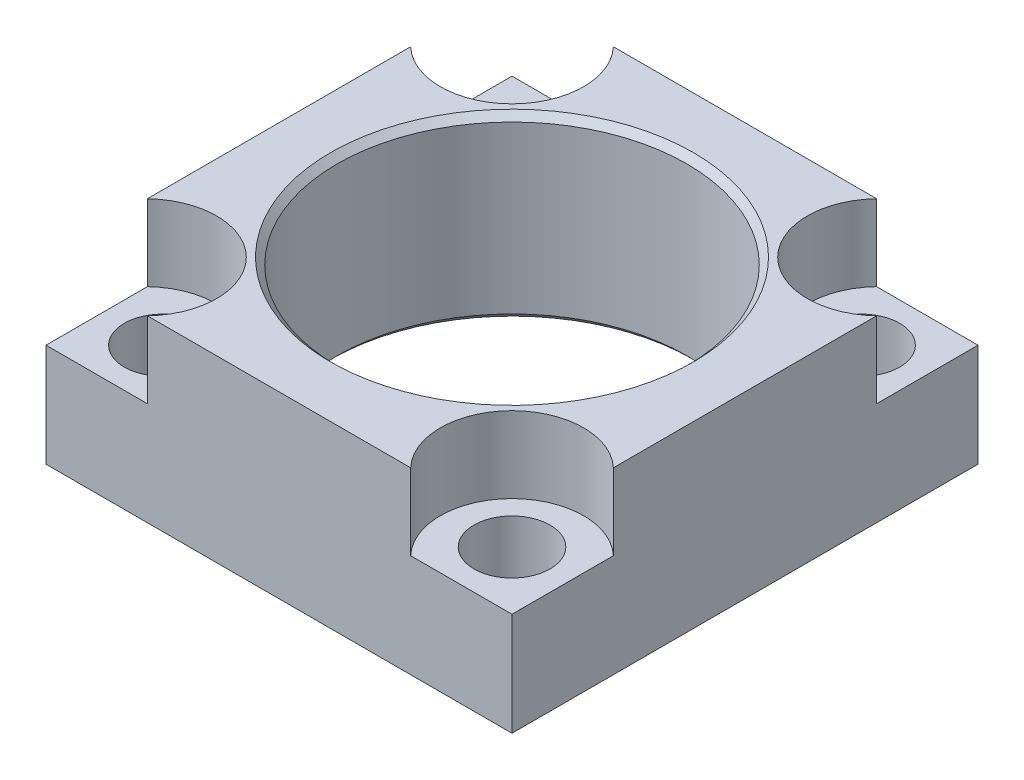
ISO-10303-21;
HEADER;
FILE_DESCRIPTION(('STEP AP214'),'2;1');
FILE_NAME('part.step','',(''),(''),'','','');
FILE_SCHEMA(('AUTOMOTIVE_DESIGN { 1 0 10303 214 1 1 1 1 }'));
ENDSEC;
DATA;
#1=APPLICATION_CONTEXT('core data for automotive mechanical design processes');
#2=APPLICATION_PROTOCOL_DEFINITION('international standard','automotive_design',2000,#1);
#3=PRODUCT_CONTEXT('',#1,'mechanical');
#4=PRODUCT('Part','Part','',(#3));
#5=PRODUCT_RELATED_PRODUCT_CATEGORY('part','',(#4));
#6=PRODUCT_DEFINITION_FORMATION('','',#4);
#7=PRODUCT_DEFINITION_CONTEXT('part definition',#1,'design');
#8=PRODUCT_DEFINITION('design','',#6,#7);
#9=PRODUCT_DEFINITION_SHAPE('','',#8);
#10=(LENGTH_UNIT() NAMED_UNIT(*) SI_UNIT(.MILLI.,.METRE.));
#11=(NAMED_UNIT(*) PLANE_ANGLE_UNIT() SI_UNIT($,.RADIAN.));
#12=(NAMED_UNIT(*) SI_UNIT($,.STERADIAN.) SOLID_ANGLE_UNIT());
#13=UNCERTAINTY_MEASURE_WITH_UNIT(LENGTH_MEASURE(1.E-05),#10,'distance_accuracy_value','');
#14=(GEOMETRIC_REPRESENTATION_CONTEXT(3) GLOBAL_UNCERTAINTY_ASSIGNED_CONTEXT((#13)) GLOBAL_UNIT_ASSIGNED_CONTEXT((#10,
#11,#12)) REPRESENTATION_CONTEXT('',''));
#15=CARTESIAN_POINT('',(0.,0.,0.));
#16=DIRECTION('',(0.,0.,1.));
#17=DIRECTION('',(1.,0.,0.));
#18=AXIS2_PLACEMENT_3D('',#15,#16,#17);
#19=CARTESIAN_POINT('',(0.,31.75,0.));
#20=DIRECTION('',(0.,-1.,0.));
#21=DIRECTION('',(0.,0.,-1.));
#22=AXIS2_PLACEMENT_3D('',#19,#20,#21);
#23=CYLINDRICAL_SURFACE('',#22,30.9753);
#24=CARTESIAN_POINT('',(0.,30.5943,0.));
#25=DIRECTION('',(0.,-1.,0.));
#26=DIRECTION('',(0.,0.,-1.));
#27=AXIS2_PLACEMENT_3D('',#24,#25,#26);
#28=CIRCLE('',#27,30.9753);
#29=CARTESIAN_POINT('',(0.,30.5943,-30.9753));
#30=VERTEX_POINT('',#29);
#31=EDGE_CURVE('E257',#30,#30,#28,.T.);
#32=ORIENTED_EDGE('',*,*,#31,.F.);
#33=EDGE_LOOP('',(#32));
#34=FACE_BOUND('',#33,.T.);
#35=CARTESIAN_POINT('',(0.,1.15570000000001,0.));
#36=DIRECTION('',(0.,-1.,0.));
#37=DIRECTION('',(0.,0.,-1.));
#38=AXIS2_PLACEMENT_3D('',#35,#36,#37);
#39=CIRCLE('',#38,30.9753);
#40=CARTESIAN_POINT('',(0.,1.15570000000001,-30.9753));
#41=VERTEX_POINT('',#40);
#42=EDGE_CURVE('E263',#41,#41,#39,.T.);
#43=ORIENTED_EDGE('',*,*,#42,.T.);
#44=EDGE_LOOP('',(#43));
#45=FACE_BOUND('',#44,.T.);
#46=ADVANCED_FACE('F33',(#34,#45),#23,.F.);
#47=CARTESIAN_POINT('',(-41.275,0.,41.275));
#48=DIRECTION('',(0.,1.,0.));
#49=DIRECTION('',(0.,0.,1.));
#50=AXIS2_PLACEMENT_3D('',#47,#48,#49);
#51=PLANE('',#50);
#52=DIRECTION('',(0.,0.,1.));
#53=VECTOR('',#52,1.);
#54=CARTESIAN_POINT('',(-41.275,0.,-41.275));
#55=LINE('',#54,#53);
#56=CARTESIAN_POINT('',(-41.275,0.,-41.275));
#57=VERTEX_POINT('',#56);
#58=CARTESIAN_POINT('',(-41.275,0.,41.275));
#59=VERTEX_POINT('',#58);
#60=EDGE_CURVE('E171',#57,#59,#55,.T.);
#61=ORIENTED_EDGE('',*,*,#60,.F.);
#62=DIRECTION('',(-1.,0.,0.));
#63=VECTOR('',#62,1.);
#64=CARTESIAN_POINT('',(-41.275,0.,-41.275));
#65=LINE('',#64,#63);
#66=CARTESIAN_POINT('',(41.275,0.,-41.275));
#67=VERTEX_POINT('',#66);
#68=EDGE_CURVE('E140',#67,#57,#65,.T.);
#69=ORIENTED_EDGE('',*,*,#68,.F.);
#70=DIRECTION('',(0.,0.,-1.));
#71=VECTOR('',#70,1.);
#72=CARTESIAN_POINT('',(41.275,0.,-41.275));
#73=LINE('',#72,#71);
#74=CARTESIAN_POINT('',(41.275,0.,41.275));
#75=VERTEX_POINT('',#74);
#76=EDGE_CURVE('E159',#75,#67,#73,.T.);
#77=ORIENTED_EDGE('',*,*,#76,.F.);
#78=DIRECTION('',(1.,0.,0.));
#79=VECTOR('',#78,1.);
#80=CARTESIAN_POINT('',(-41.275,0.,41.275));
#81=LINE('',#80,#79);
#82=EDGE_CURVE('E166',#59,#75,#81,.T.);
#83=ORIENTED_EDGE('',*,*,#82,.F.);
#84=EDGE_LOOP('',(#61,#69,#77,#83));
#85=FACE_BOUND('',#84,.T.);
#86=CARTESIAN_POINT('',(30.9626,0.,-30.9626));
#87=DIRECTION('',(0.,1.,0.));
#88=DIRECTION('',(0.,0.,1.));
#89=AXIS2_PLACEMENT_3D('',#86,#87,#88);
#90=CIRCLE('',#89,6.74370000000001);
#91=CARTESIAN_POINT('',(30.9626,0.,-24.2189));
#92=VERTEX_POINT('',#91);
#93=EDGE_CURVE('E228',#92,#92,#90,.T.);
#94=ORIENTED_EDGE('',*,*,#93,.T.);
#95=EDGE_LOOP('',(#94));
#96=FACE_BOUND('',#95,.T.);
#97=CARTESIAN_POINT('',(30.9626,0.,30.9626));
#98=DIRECTION('',(0.,1.,0.));
#99=DIRECTION('',(0.,0.,1.));
#100=AXIS2_PLACEMENT_3D('',#97,#98,#99);
#101=CIRCLE('',#100,6.74370000000001);
#102=CARTESIAN_POINT('',(30.9626,0.,37.7063));
#103=VERTEX_POINT('',#102);
#104=EDGE_CURVE('E236',#103,#103,#101,.T.);
#105=ORIENTED_EDGE('',*,*,#104,.T.);
#106=EDGE_LOOP('',(#105));
#107=FACE_BOUND('',#106,.T.);
#108=CARTESIAN_POINT('',(-30.9626,0.,-30.9626));
#109=DIRECTION('',(0.,1.,0.));
#110=DIRECTION('',(0.,0.,1.));
#111=AXIS2_PLACEMENT_3D('',#108,#109,#110);
#112=CIRCLE('',#111,6.74370000000001);
#113=CARTESIAN_POINT('',(-30.9626,0.,-24.2189));
#114=VERTEX_POINT('',#113);
#115=EDGE_CURVE('E242',#114,#114,#112,.T.);
#116=ORIENTED_EDGE('',*,*,#115,.T.);
#117=EDGE_LOOP('',(#116));
#118=FACE_BOUND('',#117,.T.);
#119=CARTESIAN_POINT('',(-30.9626,0.,30.9626));
#120=DIRECTION('',(0.,1.,0.));
#121=DIRECTION('',(0.,0.,1.));
#122=AXIS2_PLACEMENT_3D('',#119,#120,#121);
#123=CIRCLE('',#122,6.74370000000001);
#124=CARTESIAN_POINT('',(-30.9626,0.,37.7063));
#125=VERTEX_POINT('',#124);
#126=EDGE_CURVE('E248',#125,#125,#123,.T.);
#127=ORIENTED_EDGE('',*,*,#126,.T.);
#128=EDGE_LOOP('',(#127));
#129=FACE_BOUND('',#128,.T.);
#130=CARTESIAN_POINT('',(0.,0.,0.));
#131=DIRECTION('',(0.,-1.,0.));
#132=DIRECTION('',(0.,0.,-1.));
#133=AXIS2_PLACEMENT_3D('',#130,#131,#132);
#134=CIRCLE('',#133,32.131);
#135=CARTESIAN_POINT('',(0.,0.,-32.131));
#136=VERTEX_POINT('',#135);
#137=EDGE_CURVE('E260',#136,#136,#134,.T.);
#138=ORIENTED_EDGE('',*,*,#137,.F.);
#139=EDGE_LOOP('',(#138));
#140=FACE_BOUND('',#139,.T.);
#141=ADVANCED_FACE('F173',(#85,#96,#107,#118,#129,#140),#51,.F.);
#142=CARTESIAN_POINT('',(-41.275,31.75,41.275));
#143=DIRECTION('',(0.,1.,0.));
#144=DIRECTION('',(0.,0.,1.));
#145=AXIS2_PLACEMENT_3D('',#142,#143,#144);
#146=PLANE('',#145);
#147=CARTESIAN_POINT('',(-32.512,31.75,-32.512));
#148=DIRECTION('',(0.,1.,0.));
#149=DIRECTION('',(0.,0.,1.));
#150=AXIS2_PLACEMENT_3D('',#147,#148,#149);
#151=CIRCLE('',#150,12.7);
#152=CARTESIAN_POINT('',(-41.275,31.75,-23.3196210369676));
#153=VERTEX_POINT('',#152);
#154=CARTESIAN_POINT('',(-23.3196210369676,31.75,-41.275));
#155=VERTEX_POINT('',#154);
#156=EDGE_CURVE('E227',#153,#155,#151,.T.);
#157=ORIENTED_EDGE('',*,*,#156,.F.);
#158=DIRECTION('',(0.,0.,1.));
#159=VECTOR('',#158,1.);
#160=CARTESIAN_POINT('',(-41.275,31.75,-41.275));
#161=LINE('',#160,#159);
#162=CARTESIAN_POINT('',(-41.275,31.75,23.3196210369676));
#163=VERTEX_POINT('',#162);
#164=EDGE_CURVE('E175',#153,#163,#161,.T.);
#165=ORIENTED_EDGE('',*,*,#164,.T.);
#166=CARTESIAN_POINT('',(-32.512,31.75,32.512));
#167=DIRECTION('',(0.,1.,0.));
#168=DIRECTION('',(0.,0.,-1.));
#169=AXIS2_PLACEMENT_3D('',#166,#167,#168);
#170=CIRCLE('',#169,12.7);
#171=CARTESIAN_POINT('',(-23.3196210369676,31.75,41.275));
#172=VERTEX_POINT('',#171);
#173=EDGE_CURVE('E190',#172,#163,#170,.T.);
#174=ORIENTED_EDGE('',*,*,#173,.F.);
#175=DIRECTION('',(1.,0.,0.));
#176=VECTOR('',#175,1.);
#177=CARTESIAN_POINT('',(-41.275,31.75,41.275));
#178=LINE('',#177,#176);
#179=CARTESIAN_POINT('',(23.3196210369676,31.75,41.275));
#180=VERTEX_POINT('',#179);
#181=EDGE_CURVE('E181',#172,#180,#178,.T.);
#182=ORIENTED_EDGE('',*,*,#181,.T.);
#183=CARTESIAN_POINT('',(32.512,31.75,32.512));
#184=DIRECTION('',(0.,1.,0.));
#185=DIRECTION('',(0.,0.,1.));
#186=AXIS2_PLACEMENT_3D('',#183,#184,#185);
#187=CIRCLE('',#186,12.7);
#188=CARTESIAN_POINT('',(41.275,31.75,23.3196210369676));
#189=VERTEX_POINT('',#188);
#190=EDGE_CURVE('E206',#189,#180,#187,.T.);
#191=ORIENTED_EDGE('',*,*,#190,.F.);
#192=DIRECTION('',(0.,0.,-1.));
#193=VECTOR('',#192,1.);
#194=CARTESIAN_POINT('',(41.275,31.75,-41.275));
#195=LINE('',#194,#193);
#196=CARTESIAN_POINT('',(41.275,31.75,-23.3196210369676));
#197=VERTEX_POINT('',#196);
#198=EDGE_CURVE('E147',#189,#197,#195,.T.);
#199=ORIENTED_EDGE('',*,*,#198,.T.);
#200=CARTESIAN_POINT('',(32.512,31.75,-32.512));
#201=DIRECTION('',(0.,1.,0.));
#202=DIRECTION('',(0.,0.,-1.));
#203=AXIS2_PLACEMENT_3D('',#200,#201,#202);
#204=CIRCLE('',#203,12.7);
#205=CARTESIAN_POINT('',(23.3196210369676,31.75,-41.275));
#206=VERTEX_POINT('',#205);
#207=EDGE_CURVE('E218',#206,#197,#204,.T.);
#208=ORIENTED_EDGE('',*,*,#207,.F.);
#209=DIRECTION('',(-1.,0.,0.));
#210=VECTOR('',#209,1.);
#211=CARTESIAN_POINT('',(-41.275,31.75,-41.275));
#212=LINE('',#211,#210);
#213=EDGE_CURVE('E143',#206,#155,#212,.T.);
#214=ORIENTED_EDGE('',*,*,#213,.T.);
#215=EDGE_LOOP('',(#157,#165,#174,#182,#191,#199,#208,#214));
#216=FACE_BOUND('',#215,.T.);
#217=CARTESIAN_POINT('',(0.,31.75,0.));
#218=DIRECTION('',(0.,-1.,0.));
#219=DIRECTION('',(0.,0.,-1.));
#220=AXIS2_PLACEMENT_3D('',#217,#218,#219);
#221=CIRCLE('',#220,32.131);
#222=CARTESIAN_POINT('',(0.,31.75,-32.131));
#223=VERTEX_POINT('',#222);
#224=EDGE_CURVE('E254',#223,#223,#221,.T.);
#225=ORIENTED_EDGE('',*,*,#224,.T.);
#226=EDGE_LOOP('',(#225));
#227=FACE_BOUND('',#226,.T.);
#228=ADVANCED_FACE('F285',(#216,#227),#146,.T.);
#229=CARTESIAN_POINT('',(-32.512,18.2626,32.512));
#230=DIRECTION('',(0.,-1.,0.));
#231=DIRECTION('',(0.,0.,-1.));
#232=AXIS2_PLACEMENT_3D('',#229,#230,#231);
#233=PLANE('',#232);
#234=DIRECTION('',(1.,0.,0.));
#235=VECTOR('',#234,1.);
#236=CARTESIAN_POINT('',(-23.3196210369676,18.2626,41.275));
#237=LINE('',#236,#235);
#238=CARTESIAN_POINT('',(-41.275,18.2626,41.275));
#239=VERTEX_POINT('',#238);
#240=CARTESIAN_POINT('',(-23.3196210369676,18.2626,41.275));
#241=VERTEX_POINT('',#240);
#242=EDGE_CURVE('E193',#239,#241,#237,.T.);
#243=ORIENTED_EDGE('',*,*,#242,.T.);
#244=CARTESIAN_POINT('',(-32.512,18.2626,32.512));
#245=DIRECTION('',(0.,1.,0.));
#246=DIRECTION('',(0.,0.,-1.));
#247=AXIS2_PLACEMENT_3D('',#244,#245,#246);
#248=CIRCLE('',#247,12.7);
#249=CARTESIAN_POINT('',(-41.275,18.2626,23.3196210369676));
#250=VERTEX_POINT('',#249);
#251=EDGE_CURVE('E196',#241,#250,#248,.T.);
#252=ORIENTED_EDGE('',*,*,#251,.T.);
#253=DIRECTION('',(0.,0.,1.));
#254=VECTOR('',#253,1.);
#255=CARTESIAN_POINT('',(-41.275,18.2626,41.275));
#256=LINE('',#255,#254);
#257=EDGE_CURVE('E187',#250,#239,#256,.T.);
#258=ORIENTED_EDGE('',*,*,#257,.T.);
#259=EDGE_LOOP('',(#243,#252,#258));
#260=FACE_BOUND('',#259,.T.);
#261=CARTESIAN_POINT('',(-30.9626,18.2626,30.9626));
#262=DIRECTION('',(0.,1.,0.));
#263=DIRECTION('',(0.,0.,1.));
#264=AXIS2_PLACEMENT_3D('',#261,#262,#263);
#265=CIRCLE('',#264,6.74370000000001);
#266=CARTESIAN_POINT('',(-30.9626,18.2626,37.7063));
#267=VERTEX_POINT('',#266);
#268=EDGE_CURVE('E251',#267,#267,#265,.T.);
#269=ORIENTED_EDGE('',*,*,#268,.F.);
#270=EDGE_LOOP('',(#269));
#271=FACE_BOUND('',#270,.T.);
#272=ADVANCED_FACE('F293',(#260,#271),#233,.F.);
#273=CARTESIAN_POINT('',(32.512,18.2626,-32.512));
#274=DIRECTION('',(0.,-1.,0.));
#275=DIRECTION('',(0.,0.,-1.));
#276=AXIS2_PLACEMENT_3D('',#273,#274,#275);
#277=PLANE('',#276);
#278=DIRECTION('',(-1.,0.,0.));
#279=VECTOR('',#278,1.);
#280=CARTESIAN_POINT('',(23.3196210369676,18.2626,-41.275));
#281=LINE('',#280,#279);
#282=CARTESIAN_POINT('',(41.275,18.2626,-41.275));
#283=VERTEX_POINT('',#282);
#284=CARTESIAN_POINT('',(23.3196210369676,18.2626,-41.275));
#285=VERTEX_POINT('',#284);
#286=EDGE_CURVE('E220',#283,#285,#281,.T.);
#287=ORIENTED_EDGE('',*,*,#286,.T.);
#288=CARTESIAN_POINT('',(32.512,18.2626,-32.512));
#289=DIRECTION('',(0.,1.,0.));
#290=DIRECTION('',(0.,0.,-1.));
#291=AXIS2_PLACEMENT_3D('',#288,#289,#290);
#292=CIRCLE('',#291,12.7);
#293=CARTESIAN_POINT('',(41.275,18.2626,-23.3196210369676));
#294=VERTEX_POINT('',#293);
#295=EDGE_CURVE('E222',#285,#294,#292,.T.);
#296=ORIENTED_EDGE('',*,*,#295,.T.);
#297=DIRECTION('',(0.,0.,-1.));
#298=VECTOR('',#297,1.);
#299=CARTESIAN_POINT('',(41.275,18.2626,-41.275));
#300=LINE('',#299,#298);
#301=EDGE_CURVE('E56',#294,#283,#300,.T.);
#302=ORIENTED_EDGE('',*,*,#301,.T.);
#303=EDGE_LOOP('',(#287,#296,#302));
#304=FACE_BOUND('',#303,.T.);
#305=CARTESIAN_POINT('',(30.9626,18.2626,-30.9626));
#306=DIRECTION('',(0.,1.,0.));
#307=DIRECTION('',(0.,0.,1.));
#308=AXIS2_PLACEMENT_3D('',#305,#306,#307);
#309=CIRCLE('',#308,6.74370000000001);
#310=CARTESIAN_POINT('',(30.9626,18.2626,-24.2189));
#311=VERTEX_POINT('',#310);
#312=EDGE_CURVE('E233',#311,#311,#309,.T.);
#313=ORIENTED_EDGE('',*,*,#312,.F.);
#314=EDGE_LOOP('',(#313));
#315=FACE_BOUND('',#314,.T.);
#316=ADVANCED_FACE('F303',(#304,#315),#277,.F.);
#317=CARTESIAN_POINT('',(-41.275,31.75,-41.275));
#318=DIRECTION('',(1.,0.,0.));
#319=DIRECTION('',(0.,0.,-1.));
#320=AXIS2_PLACEMENT_3D('',#317,#318,#319);
#321=PLANE('',#320);
#322=ORIENTED_EDGE('',*,*,#164,.F.);
#323=DIRECTION('',(0.,1.,0.));
#324=VECTOR('',#323,1.);
#325=CARTESIAN_POINT('',(-41.275,18.2626,-23.3196210369676));
#326=LINE('',#325,#324);
#327=CARTESIAN_POINT('',(-41.275,18.2626,-23.3196210369676));
#328=VERTEX_POINT('',#327);
#329=EDGE_CURVE('E135',#328,#153,#326,.T.);
#330=ORIENTED_EDGE('',*,*,#329,.F.);
#331=DIRECTION('',(0.,0.,1.));
#332=VECTOR('',#331,1.);
#333=CARTESIAN_POINT('',(-41.275,18.2626,-41.275));
#334=LINE('',#333,#332);
#335=CARTESIAN_POINT('',(-41.275,18.2626,-41.275));
#336=VERTEX_POINT('',#335);
#337=EDGE_CURVE('E124',#336,#328,#334,.T.);
#338=ORIENTED_EDGE('',*,*,#337,.F.);
#339=DIRECTION('',(0.,-1.,0.));
#340=VECTOR('',#339,1.);
#341=CARTESIAN_POINT('',(-41.275,31.75,-41.275));
#342=LINE('',#341,#340);
#343=EDGE_CURVE('E133',#336,#57,#342,.T.);
#344=ORIENTED_EDGE('',*,*,#343,.T.);
#345=ORIENTED_EDGE('',*,*,#60,.T.);
#346=DIRECTION('',(0.,-1.,0.));
#347=VECTOR('',#346,1.);
#348=CARTESIAN_POINT('',(-41.275,31.75,41.275));
#349=LINE('',#348,#347);
#350=EDGE_CURVE('E11',#239,#59,#349,.T.);
#351=ORIENTED_EDGE('',*,*,#350,.F.);
#352=ORIENTED_EDGE('',*,*,#257,.F.);
#353=DIRECTION('',(0.,1.,0.));
#354=VECTOR('',#353,1.);
#355=CARTESIAN_POINT('',(-41.275,18.2626,23.3196210369676));
#356=LINE('',#355,#354);
#357=EDGE_CURVE('E177',#250,#163,#356,.T.);
#358=ORIENTED_EDGE('',*,*,#357,.T.);
#359=EDGE_LOOP('',(#322,#330,#338,#344,#345,#351,#352,#358));
#360=FACE_BOUND('',#359,.T.);
#361=ADVANCED_FACE('F35',(#360),#321,.F.);
#362=CARTESIAN_POINT('',(-41.275,31.75,41.275));
#363=DIRECTION('',(0.,0.,-1.));
#364=DIRECTION('',(-1.,0.,0.));
#365=AXIS2_PLACEMENT_3D('',#362,#363,#364);
#366=PLANE('',#365);
#367=DIRECTION('',(1.,0.,0.));
#368=VECTOR('',#367,1.);
#369=CARTESIAN_POINT('',(23.3196210369676,18.2626,41.275));
#370=LINE('',#369,#368);
#371=CARTESIAN_POINT('',(23.3196210369676,18.2626,41.275));
#372=VERTEX_POINT('',#371);
#373=CARTESIAN_POINT('',(41.275,18.2626,41.275));
#374=VERTEX_POINT('',#373);
#375=EDGE_CURVE('E203',#372,#374,#370,.T.);
#376=ORIENTED_EDGE('',*,*,#375,.F.);
#377=DIRECTION('',(0.,1.,0.));
#378=VECTOR('',#377,1.);
#379=CARTESIAN_POINT('',(23.3196210369676,18.2626,41.275));
#380=LINE('',#379,#378);
#381=EDGE_CURVE('E194',#372,#180,#380,.T.);
#382=ORIENTED_EDGE('',*,*,#381,.T.);
#383=ORIENTED_EDGE('',*,*,#181,.F.);
#384=DIRECTION('',(0.,1.,0.));
#385=VECTOR('',#384,1.);
#386=CARTESIAN_POINT('',(-23.3196210369676,18.2626,41.275));
#387=LINE('',#386,#385);
#388=EDGE_CURVE('E185',#241,#172,#387,.T.);
#389=ORIENTED_EDGE('',*,*,#388,.F.);
#390=ORIENTED_EDGE('',*,*,#242,.F.);
#391=ORIENTED_EDGE('',*,*,#350,.T.);
#392=ORIENTED_EDGE('',*,*,#82,.T.);
#393=DIRECTION('',(0.,-1.,0.));
#394=VECTOR('',#393,1.);
#395=CARTESIAN_POINT('',(41.275,31.75,41.275));
#396=LINE('',#395,#394);
#397=EDGE_CURVE('E41',#374,#75,#396,.T.);
#398=ORIENTED_EDGE('',*,*,#397,.F.);
#399=EDGE_LOOP('',(#376,#382,#383,#389,#390,#391,#392,#398));
#400=FACE_BOUND('',#399,.T.);
#401=ADVANCED_FACE('F167',(#400),#366,.F.);
#402=CARTESIAN_POINT('',(41.275,31.75,-41.275));
#403=DIRECTION('',(-1.,0.,0.));
#404=DIRECTION('',(0.,0.,1.));
#405=AXIS2_PLACEMENT_3D('',#402,#403,#404);
#406=PLANE('',#405);
#407=ORIENTED_EDGE('',*,*,#301,.F.);
#408=DIRECTION('',(0.,1.,0.));
#409=VECTOR('',#408,1.);
#410=CARTESIAN_POINT('',(41.275,18.2626,-23.3196210369676));
#411=LINE('',#410,#409);
#412=EDGE_CURVE('E208',#294,#197,#411,.T.);
#413=ORIENTED_EDGE('',*,*,#412,.T.);
#414=ORIENTED_EDGE('',*,*,#198,.F.);
#415=DIRECTION('',(0.,1.,0.));
#416=VECTOR('',#415,1.);
#417=CARTESIAN_POINT('',(41.275,18.2626,23.3196210369676));
#418=LINE('',#417,#416);
#419=CARTESIAN_POINT('',(41.275,18.2626,23.3196210369676));
#420=VERTEX_POINT('',#419);
#421=EDGE_CURVE('E201',#420,#189,#418,.T.);
#422=ORIENTED_EDGE('',*,*,#421,.F.);
#423=DIRECTION('',(0.,0.,-1.));
#424=VECTOR('',#423,1.);
#425=CARTESIAN_POINT('',(41.275,18.2626,41.275));
#426=LINE('',#425,#424);
#427=EDGE_CURVE('E162',#374,#420,#426,.T.);
#428=ORIENTED_EDGE('',*,*,#427,.F.);
#429=ORIENTED_EDGE('',*,*,#397,.T.);
#430=ORIENTED_EDGE('',*,*,#76,.T.);
#431=DIRECTION('',(0.,-1.,0.));
#432=VECTOR('',#431,1.);
#433=CARTESIAN_POINT('',(41.275,31.75,-41.275));
#434=LINE('',#433,#432);
#435=EDGE_CURVE('E142',#283,#67,#434,.T.);
#436=ORIENTED_EDGE('',*,*,#435,.F.);
#437=EDGE_LOOP('',(#407,#413,#414,#422,#428,#429,#430,#436));
#438=FACE_BOUND('',#437,.T.);
#439=ADVANCED_FACE('F156',(#438),#406,.F.);
#440=CARTESIAN_POINT('',(-41.275,31.75,-41.275));
#441=DIRECTION('',(0.,0.,1.));
#442=DIRECTION('',(1.,0.,0.));
#443=AXIS2_PLACEMENT_3D('',#440,#441,#442);
#444=PLANE('',#443);
#445=DIRECTION('',(-1.,0.,0.));
#446=VECTOR('',#445,1.);
#447=CARTESIAN_POINT('',(-23.3196210369676,18.2626,-41.275));
#448=LINE('',#447,#446);
#449=CARTESIAN_POINT('',(-23.3196210369676,18.2626,-41.275));
#450=VERTEX_POINT('',#449);
#451=EDGE_CURVE('E121',#450,#336,#448,.T.);
#452=ORIENTED_EDGE('',*,*,#451,.F.);
#453=DIRECTION('',(0.,1.,0.));
#454=VECTOR('',#453,1.);
#455=CARTESIAN_POINT('',(-23.3196210369676,18.2626,-41.275));
#456=LINE('',#455,#454);
#457=EDGE_CURVE('E136',#450,#155,#456,.T.);
#458=ORIENTED_EDGE('',*,*,#457,.T.);
#459=ORIENTED_EDGE('',*,*,#213,.F.);
#460=DIRECTION('',(0.,1.,0.));
#461=VECTOR('',#460,1.);
#462=CARTESIAN_POINT('',(23.3196210369676,18.2626,-41.275));
#463=LINE('',#462,#461);
#464=EDGE_CURVE('E214',#285,#206,#463,.T.);
#465=ORIENTED_EDGE('',*,*,#464,.F.);
#466=ORIENTED_EDGE('',*,*,#286,.F.);
#467=ORIENTED_EDGE('',*,*,#435,.T.);
#468=ORIENTED_EDGE('',*,*,#68,.T.);
#469=ORIENTED_EDGE('',*,*,#343,.F.);
#470=EDGE_LOOP('',(#452,#458,#459,#465,#466,#467,#468,#469));
#471=FACE_BOUND('',#470,.T.);
#472=ADVANCED_FACE('F138',(#471),#444,.F.);
#473=CARTESIAN_POINT('',(-32.512,18.2626,32.512));
#474=DIRECTION('',(0.,1.,0.));
#475=DIRECTION('',(0.,0.,1.));
#476=AXIS2_PLACEMENT_3D('',#473,#474,#475);
#477=CYLINDRICAL_SURFACE('',#476,12.7);
#478=ORIENTED_EDGE('',*,*,#173,.T.);
#479=ORIENTED_EDGE('',*,*,#357,.F.);
#480=ORIENTED_EDGE('',*,*,#251,.F.);
#481=ORIENTED_EDGE('',*,*,#388,.T.);
#482=EDGE_LOOP('',(#478,#479,#480,#481));
#483=FACE_BOUND('',#482,.T.);
#484=ADVANCED_FACE('F290',(#483),#477,.F.);
#485=CARTESIAN_POINT('',(32.512,18.2626,32.512));
#486=DIRECTION('',(0.,1.,0.));
#487=DIRECTION('',(0.,0.,1.));
#488=AXIS2_PLACEMENT_3D('',#485,#486,#487);
#489=CYLINDRICAL_SURFACE('',#488,12.7);
#490=ORIENTED_EDGE('',*,*,#190,.T.);
#491=ORIENTED_EDGE('',*,*,#381,.F.);
#492=CARTESIAN_POINT('',(32.512,18.2626,32.512));
#493=DIRECTION('',(0.,1.,0.));
#494=DIRECTION('',(0.,0.,1.));
#495=AXIS2_PLACEMENT_3D('',#492,#493,#494);
#496=CIRCLE('',#495,12.7);
#497=EDGE_CURVE('E210',#420,#372,#496,.T.);
#498=ORIENTED_EDGE('',*,*,#497,.F.);
#499=ORIENTED_EDGE('',*,*,#421,.T.);
#500=EDGE_LOOP('',(#490,#491,#498,#499));
#501=FACE_BOUND('',#500,.T.);
#502=ADVANCED_FACE('F324',(#501),#489,.F.);
#503=CARTESIAN_POINT('',(32.512,18.2626,32.512));
#504=DIRECTION('',(0.,1.,0.));
#505=DIRECTION('',(0.,0.,1.));
#506=AXIS2_PLACEMENT_3D('',#503,#504,#505);
#507=PLANE('',#506);
#508=CARTESIAN_POINT('',(30.9626,18.2626,30.9626));
#509=DIRECTION('',(0.,1.,0.));
#510=DIRECTION('',(0.,0.,1.));
#511=AXIS2_PLACEMENT_3D('',#508,#509,#510);
#512=CIRCLE('',#511,6.74370000000001);
#513=CARTESIAN_POINT('',(30.9626,18.2626,37.7063));
#514=VERTEX_POINT('',#513);
#515=EDGE_CURVE('E239',#514,#514,#512,.T.);
#516=ORIENTED_EDGE('',*,*,#515,.F.);
#517=EDGE_LOOP('',(#516));
#518=FACE_BOUND('',#517,.T.);
#519=ORIENTED_EDGE('',*,*,#427,.T.);
#520=ORIENTED_EDGE('',*,*,#497,.T.);
#521=ORIENTED_EDGE('',*,*,#375,.T.);
#522=EDGE_LOOP('',(#519,#520,#521));
#523=FACE_BOUND('',#522,.T.);
#524=ADVANCED_FACE('F320',(#518,#523),#507,.T.);
#525=CARTESIAN_POINT('',(32.512,18.2626,-32.512));
#526=DIRECTION('',(0.,1.,0.));
#527=DIRECTION('',(0.,0.,1.));
#528=AXIS2_PLACEMENT_3D('',#525,#526,#527);
#529=CYLINDRICAL_SURFACE('',#528,12.7);
#530=ORIENTED_EDGE('',*,*,#207,.T.);
#531=ORIENTED_EDGE('',*,*,#412,.F.);
#532=ORIENTED_EDGE('',*,*,#295,.F.);
#533=ORIENTED_EDGE('',*,*,#464,.T.);
#534=EDGE_LOOP('',(#530,#531,#532,#533));
#535=FACE_BOUND('',#534,.T.);
#536=ADVANCED_FACE('F317',(#535),#529,.F.);
#537=CARTESIAN_POINT('',(-32.512,18.2626,-32.512));
#538=DIRECTION('',(0.,1.,0.));
#539=DIRECTION('',(0.,0.,1.));
#540=AXIS2_PLACEMENT_3D('',#537,#538,#539);
#541=CYLINDRICAL_SURFACE('',#540,12.7);
#542=ORIENTED_EDGE('',*,*,#156,.T.);
#543=ORIENTED_EDGE('',*,*,#457,.F.);
#544=CARTESIAN_POINT('',(-32.512,18.2626,-32.512));
#545=DIRECTION('',(0.,1.,0.));
#546=DIRECTION('',(0.,0.,1.));
#547=AXIS2_PLACEMENT_3D('',#544,#545,#546);
#548=CIRCLE('',#547,12.7);
#549=EDGE_CURVE('E48',#328,#450,#548,.T.);
#550=ORIENTED_EDGE('',*,*,#549,.F.);
#551=ORIENTED_EDGE('',*,*,#329,.T.);
#552=EDGE_LOOP('',(#542,#543,#550,#551));
#553=FACE_BOUND('',#552,.T.);
#554=ADVANCED_FACE('F315',(#553),#541,.F.);
#555=CARTESIAN_POINT('',(-32.512,18.2626,-32.512));
#556=DIRECTION('',(0.,1.,0.));
#557=DIRECTION('',(0.,0.,1.));
#558=AXIS2_PLACEMENT_3D('',#555,#556,#557);
#559=PLANE('',#558);
#560=CARTESIAN_POINT('',(-30.9626,18.2626,-30.9626));
#561=DIRECTION('',(0.,1.,0.));
#562=DIRECTION('',(0.,0.,1.));
#563=AXIS2_PLACEMENT_3D('',#560,#561,#562);
#564=CIRCLE('',#563,6.74370000000001);
#565=CARTESIAN_POINT('',(-30.9626,18.2626,-24.2189));
#566=VERTEX_POINT('',#565);
#567=EDGE_CURVE('E245',#566,#566,#564,.T.);
#568=ORIENTED_EDGE('',*,*,#567,.F.);
#569=EDGE_LOOP('',(#568));
#570=FACE_BOUND('',#569,.T.);
#571=ORIENTED_EDGE('',*,*,#549,.T.);
#572=ORIENTED_EDGE('',*,*,#451,.T.);
#573=ORIENTED_EDGE('',*,*,#337,.T.);
#574=EDGE_LOOP('',(#571,#572,#573));
#575=FACE_BOUND('',#574,.T.);
#576=ADVANCED_FACE('F123',(#570,#575),#559,.T.);
#577=CARTESIAN_POINT('',(30.9626,18.2626,-30.9626));
#578=DIRECTION('',(0.,1.,0.));
#579=DIRECTION('',(0.,0.,1.));
#580=AXIS2_PLACEMENT_3D('',#577,#578,#579);
#581=CYLINDRICAL_SURFACE('',#580,6.74370000000001);
#582=ORIENTED_EDGE('',*,*,#93,.F.);
#583=EDGE_LOOP('',(#582));
#584=FACE_BOUND('',#583,.T.);
#585=ORIENTED_EDGE('',*,*,#312,.T.);
#586=EDGE_LOOP('',(#585));
#587=FACE_BOUND('',#586,.T.);
#588=ADVANCED_FACE('F357',(#584,#587),#581,.F.);
#589=CARTESIAN_POINT('',(30.9626,18.2626,30.9626));
#590=DIRECTION('',(0.,1.,0.));
#591=DIRECTION('',(0.,0.,1.));
#592=AXIS2_PLACEMENT_3D('',#589,#590,#591);
#593=CYLINDRICAL_SURFACE('',#592,6.74370000000001);
#594=ORIENTED_EDGE('',*,*,#104,.F.);
#595=EDGE_LOOP('',(#594));
#596=FACE_BOUND('',#595,.T.);
#597=ORIENTED_EDGE('',*,*,#515,.T.);
#598=EDGE_LOOP('',(#597));
#599=FACE_BOUND('',#598,.T.);
#600=ADVANCED_FACE('F350',(#596,#599),#593,.F.);
#601=CARTESIAN_POINT('',(-30.9626,18.2626,-30.9626));
#602=DIRECTION('',(0.,1.,0.));
#603=DIRECTION('',(0.,0.,1.));
#604=AXIS2_PLACEMENT_3D('',#601,#602,#603);
#605=CYLINDRICAL_SURFACE('',#604,6.74370000000001);
#606=ORIENTED_EDGE('',*,*,#115,.F.);
#607=EDGE_LOOP('',(#606));
#608=FACE_BOUND('',#607,.T.);
#609=ORIENTED_EDGE('',*,*,#567,.T.);
#610=EDGE_LOOP('',(#609));
#611=FACE_BOUND('',#610,.T.);
#612=ADVANCED_FACE('F344',(#608,#611),#605,.F.);
#613=CARTESIAN_POINT('',(-30.9626,18.2626,30.9626));
#614=DIRECTION('',(0.,1.,0.));
#615=DIRECTION('',(0.,0.,1.));
#616=AXIS2_PLACEMENT_3D('',#613,#614,#615);
#617=CYLINDRICAL_SURFACE('',#616,6.74370000000001);
#618=ORIENTED_EDGE('',*,*,#126,.F.);
#619=EDGE_LOOP('',(#618));
#620=FACE_BOUND('',#619,.T.);
#621=ORIENTED_EDGE('',*,*,#268,.T.);
#622=EDGE_LOOP('',(#621));
#623=FACE_BOUND('',#622,.T.);
#624=ADVANCED_FACE('F276',(#620,#623),#617,.F.);
#625=CARTESIAN_POINT('',(0.,31.75,0.));
#626=DIRECTION('',(0.,1.,0.));
#627=DIRECTION('',(0.,0.,1.));
#628=AXIS2_PLACEMENT_3D('',#625,#626,#627);
#629=CONICAL_SURFACE('',#628,32.131,0.785398163397442);
#630=ORIENTED_EDGE('',*,*,#31,.T.);
#631=EDGE_LOOP('',(#630));
#632=FACE_BOUND('',#631,.T.);
#633=ORIENTED_EDGE('',*,*,#224,.F.);
#634=EDGE_LOOP('',(#633));
#635=FACE_BOUND('',#634,.T.);
#636=ADVANCED_FACE('F270',(#632,#635),#629,.F.);
#637=CARTESIAN_POINT('',(0.,1.15570000000001,0.));
#638=DIRECTION('',(0.,-1.,0.));
#639=DIRECTION('',(0.,0.,-1.));
#640=AXIS2_PLACEMENT_3D('',#637,#638,#639);
#641=CONICAL_SURFACE('',#640,30.9753,0.785398163397442);
#642=ORIENTED_EDGE('',*,*,#137,.T.);
#643=EDGE_LOOP('',(#642));
#644=FACE_BOUND('',#643,.T.);
#645=ORIENTED_EDGE('',*,*,#42,.F.);
#646=EDGE_LOOP('',(#645));
#647=FACE_BOUND('',#646,.T.);
#648=ADVANCED_FACE('F268',(#644,#647),#641,.F.);
#649=CLOSED_SHELL('',(#46,#141,#228,#272,#316,#361,#401,#439,#472,#484,#502,#524,#536,#554,#576,
#588,#600,#612,#624,#636,#648));
#650=MANIFOLD_SOLID_BREP('B2',#649);
#651=ADVANCED_BREP_SHAPE_REPRESENTATION('',(#18,#650),#14);
#652=SHAPE_DEFINITION_REPRESENTATION(#9,#651);
ENDSEC;
END-ISO-10303-21;
